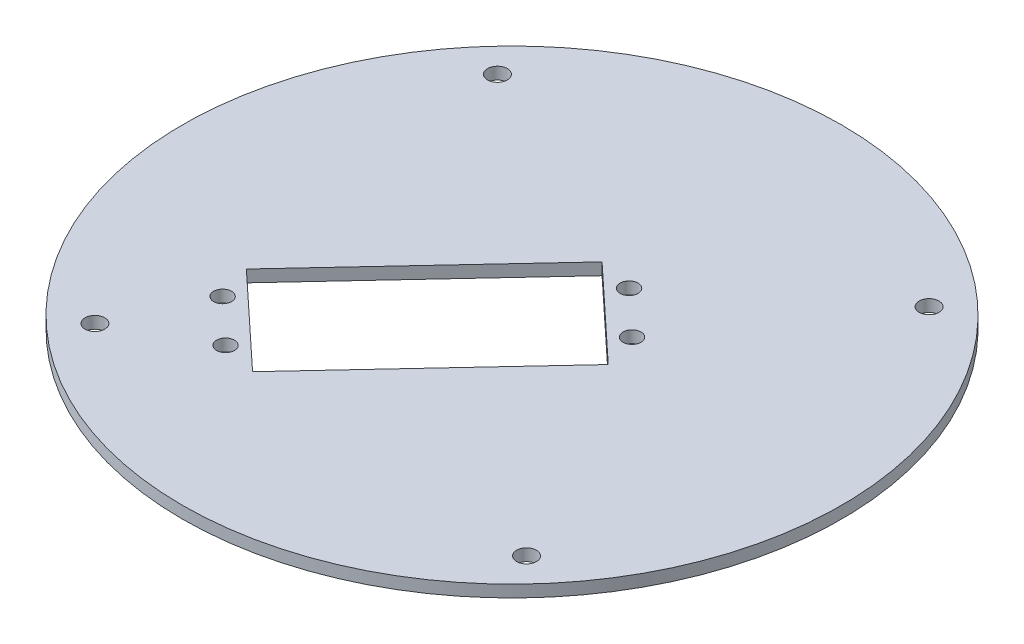
ISO-10303-21;
HEADER;
FILE_DESCRIPTION(('STEP AP214'),'2;1');
FILE_NAME('part.step','',(''),(''),'','','');
FILE_SCHEMA(('AUTOMOTIVE_DESIGN { 1 0 10303 214 1 1 1 1 }'));
ENDSEC;
DATA;
#1=APPLICATION_CONTEXT('core data for automotive mechanical design processes');
#2=APPLICATION_PROTOCOL_DEFINITION('international standard','automotive_design',2000,#1);
#3=PRODUCT_CONTEXT('',#1,'mechanical');
#4=PRODUCT('Part','Part','',(#3));
#5=PRODUCT_RELATED_PRODUCT_CATEGORY('part','',(#4));
#6=PRODUCT_DEFINITION_FORMATION('','',#4);
#7=PRODUCT_DEFINITION_CONTEXT('part definition',#1,'design');
#8=PRODUCT_DEFINITION('design','',#6,#7);
#9=PRODUCT_DEFINITION_SHAPE('','',#8);
#10=(LENGTH_UNIT() NAMED_UNIT(*) SI_UNIT(.MILLI.,.METRE.));
#11=(NAMED_UNIT(*) PLANE_ANGLE_UNIT() SI_UNIT($,.RADIAN.));
#12=(NAMED_UNIT(*) SI_UNIT($,.STERADIAN.) SOLID_ANGLE_UNIT());
#13=UNCERTAINTY_MEASURE_WITH_UNIT(LENGTH_MEASURE(1.E-05),#10,'distance_accuracy_value','');
#14=(GEOMETRIC_REPRESENTATION_CONTEXT(3) GLOBAL_UNCERTAINTY_ASSIGNED_CONTEXT((#13)) GLOBAL_UNIT_ASSIGNED_CONTEXT((#10,
#11,#12)) REPRESENTATION_CONTEXT('',''));
#15=CARTESIAN_POINT('',(0.,0.,0.));
#16=DIRECTION('',(0.,0.,1.));
#17=DIRECTION('',(1.,0.,0.));
#18=AXIS2_PLACEMENT_3D('',#15,#16,#17);
#19=CARTESIAN_POINT('',(0.,2.,0.));
#20=DIRECTION('',(0.,-1.,0.));
#21=DIRECTION('',(0.,0.,-1.));
#22=AXIS2_PLACEMENT_3D('',#19,#20,#21);
#23=CYLINDRICAL_SURFACE('',#22,55.);
#24=CARTESIAN_POINT('',(0.,2.,0.));
#25=DIRECTION('',(0.,1.,0.));
#26=DIRECTION('',(0.,0.,1.));
#27=AXIS2_PLACEMENT_3D('',#24,#25,#26);
#28=CIRCLE('',#27,55.);
#29=CARTESIAN_POINT('',(0.,2.,55.));
#30=VERTEX_POINT('',#29);
#31=EDGE_CURVE('E134',#30,#30,#28,.T.);
#32=ORIENTED_EDGE('',*,*,#31,.F.);
#33=EDGE_LOOP('',(#32));
#34=FACE_BOUND('',#33,.T.);
#35=CARTESIAN_POINT('',(0.,0.,0.));
#36=DIRECTION('',(0.,1.,0.));
#37=DIRECTION('',(0.,0.,1.));
#38=AXIS2_PLACEMENT_3D('',#35,#36,#37);
#39=CIRCLE('',#38,55.);
#40=CARTESIAN_POINT('',(0.,0.,55.));
#41=VERTEX_POINT('',#40);
#42=EDGE_CURVE('E131',#41,#41,#39,.T.);
#43=ORIENTED_EDGE('',*,*,#42,.T.);
#44=EDGE_LOOP('',(#43));
#45=FACE_BOUND('',#44,.T.);
#46=ADVANCED_FACE('F38',(#34,#45),#23,.T.);
#47=CARTESIAN_POINT('',(0.,2.,0.));
#48=DIRECTION('',(0.,1.,0.));
#49=DIRECTION('',(0.,0.,1.));
#50=AXIS2_PLACEMENT_3D('',#47,#48,#49);
#51=PLANE('',#50);
#52=CARTESIAN_POINT('',(13.2052125144257,2.,-6.82805700392381));
#53=DIRECTION('',(0.,1.,0.));
#54=DIRECTION('',(0.,0.,1.));
#55=AXIS2_PLACEMENT_3D('',#52,#53,#54);
#56=CIRCLE('',#55,1.50000000000064);
#57=CARTESIAN_POINT('',(13.2052125144257,2.,-5.32805700392318));
#58=VERTEX_POINT('',#57);
#59=EDGE_CURVE('E240',#58,#58,#56,.T.);
#60=ORIENTED_EDGE('',*,*,#59,.F.);
#61=EDGE_LOOP('',(#60));
#62=FACE_BOUND('',#61,.T.);
#63=CARTESIAN_POINT('',(5.89214189781606,2.,-13.648540722582));
#64=DIRECTION('',(0.,1.,0.));
#65=DIRECTION('',(0.,0.,1.));
#66=AXIS2_PLACEMENT_3D('',#63,#64,#65);
#67=CIRCLE('',#66,1.50000000000069);
#68=CARTESIAN_POINT('',(5.89214189781606,2.,-12.1485407225813));
#69=VERTEX_POINT('',#68);
#70=EDGE_CURVE('E242',#69,#69,#67,.T.);
#71=ORIENTED_EDGE('',*,*,#70,.F.);
#72=EDGE_LOOP('',(#71));
#73=FACE_BOUND('',#72,.T.);
#74=CARTESIAN_POINT('',(-19.5331093351335,2.,28.2746819558017));
#75=DIRECTION('',(0.,1.,0.));
#76=DIRECTION('',(0.,0.,1.));
#77=AXIS2_PLACEMENT_3D('',#74,#75,#76);
#78=CIRCLE('',#77,1.5);
#79=CARTESIAN_POINT('',(-19.5331093351335,2.,29.7746819558017));
#80=VERTEX_POINT('',#79);
#81=EDGE_CURVE('E237',#80,#80,#78,.T.);
#82=ORIENTED_EDGE('',*,*,#81,.F.);
#83=EDGE_LOOP('',(#82));
#84=FACE_BOUND('',#83,.T.);
#85=CARTESIAN_POINT('',(-26.8461799517431,2.,21.4541982371436));
#86=DIRECTION('',(0.,1.,0.));
#87=DIRECTION('',(0.,0.,1.));
#88=AXIS2_PLACEMENT_3D('',#85,#86,#87);
#89=CIRCLE('',#88,1.5);
#90=CARTESIAN_POINT('',(-26.8461799517431,2.,22.9541982371436));
#91=VERTEX_POINT('',#90);
#92=EDGE_CURVE('E235',#91,#91,#89,.T.);
#93=ORIENTED_EDGE('',*,*,#92,.F.);
#94=EDGE_LOOP('',(#93));
#95=FACE_BOUND('',#94,.T.);
#96=DIRECTION('',(0.731307061660964,0.,0.682048371865814));
#97=VECTOR('',#96,1.);
#98=CARTESIAN_POINT('',(-13.4647753804003,2.,29.8320268160818));
#99=LINE('',#98,#97);
#100=CARTESIAN_POINT('',(-28.8222236752809,2.,15.5090110068993));
#101=VERTEX_POINT('',#100);
#102=CARTESIAN_POINT('',(-13.4647753804003,2.,29.8320268160818));
#103=VERTEX_POINT('',#102);
#104=EDGE_CURVE('E54',#101,#103,#99,.T.);
#105=ORIENTED_EDGE('',*,*,#104,.F.);
#106=DIRECTION('',(-0.682048371865815,0.,0.731307061660963));
#107=VECTOR('',#106,1.);
#108=CARTESIAN_POINT('',(-28.8222236752809,2.,15.5090110068993));
#109=LINE('',#108,#107);
#110=CARTESIAN_POINT('',(-0.176192056916675,2.,-15.2058855828611));
#111=VERTEX_POINT('',#110);
#112=EDGE_CURVE('E99',#111,#101,#109,.T.);
#113=ORIENTED_EDGE('',*,*,#112,.F.);
#114=DIRECTION('',(-0.731307061660963,0.,-0.682048371865815));
#115=VECTOR('',#114,1.);
#116=CARTESIAN_POINT('',(-0.176192056916675,2.,-15.2058855828611));
#117=LINE('',#116,#115);
#118=CARTESIAN_POINT('',(15.1812562379635,2.,-0.882869773678998));
#119=VERTEX_POINT('',#118);
#120=EDGE_CURVE('E83',#119,#111,#117,.T.);
#121=ORIENTED_EDGE('',*,*,#120,.F.);
#122=DIRECTION('',(0.682048371865806,0.,-0.731307061660971));
#123=VECTOR('',#122,1.);
#124=CARTESIAN_POINT('',(15.1812562379635,2.,-0.882869773678998));
#125=LINE('',#124,#123);
#126=EDGE_CURVE('E92',#103,#119,#125,.T.);
#127=ORIENTED_EDGE('',*,*,#126,.F.);
#128=EDGE_LOOP('',(#105,#113,#121,#127));
#129=FACE_BOUND('',#128,.T.);
#130=CARTESIAN_POINT('',(-33.5908823143915,2.,36.0168727868026));
#131=DIRECTION('',(0.,1.,0.));
#132=DIRECTION('',(0.,0.,1.));
#133=AXIS2_PLACEMENT_3D('',#130,#131,#132);
#134=CIRCLE('',#133,1.65);
#135=CARTESIAN_POINT('',(-33.5908823143915,2.,37.6668727868026));
#136=VERTEX_POINT('',#135);
#137=EDGE_CURVE('E113',#136,#136,#134,.T.);
#138=ORIENTED_EDGE('',*,*,#137,.F.);
#139=EDGE_LOOP('',(#138));
#140=FACE_BOUND('',#139,.T.);
#141=CARTESIAN_POINT('',(-36.0168727868026,2.,-33.5908823143915));
#142=DIRECTION('',(0.,1.,0.));
#143=DIRECTION('',(0.,0.,1.));
#144=AXIS2_PLACEMENT_3D('',#141,#142,#143);
#145=CIRCLE('',#144,1.65);
#146=CARTESIAN_POINT('',(-36.0168727868026,2.,-31.9408823143915));
#147=VERTEX_POINT('',#146);
#148=EDGE_CURVE('E116',#147,#147,#145,.T.);
#149=ORIENTED_EDGE('',*,*,#148,.F.);
#150=EDGE_LOOP('',(#149));
#151=FACE_BOUND('',#150,.T.);
#152=CARTESIAN_POINT('',(33.5908823143915,2.,-36.0168727868026));
#153=DIRECTION('',(0.,1.,0.));
#154=DIRECTION('',(0.,0.,1.));
#155=AXIS2_PLACEMENT_3D('',#152,#153,#154);
#156=CIRCLE('',#155,1.65);
#157=CARTESIAN_POINT('',(33.5908823143915,2.,-34.3668727868026));
#158=VERTEX_POINT('',#157);
#159=EDGE_CURVE('E122',#158,#158,#156,.T.);
#160=ORIENTED_EDGE('',*,*,#159,.F.);
#161=EDGE_LOOP('',(#160));
#162=FACE_BOUND('',#161,.T.);
#163=CARTESIAN_POINT('',(36.0168727868026,2.,33.5908823143915));
#164=DIRECTION('',(0.,1.,0.));
#165=DIRECTION('',(0.,0.,1.));
#166=AXIS2_PLACEMENT_3D('',#163,#164,#165);
#167=CIRCLE('',#166,1.65);
#168=CARTESIAN_POINT('',(36.0168727868026,2.,35.2408823143915));
#169=VERTEX_POINT('',#168);
#170=EDGE_CURVE('E112',#169,#169,#167,.T.);
#171=ORIENTED_EDGE('',*,*,#170,.F.);
#172=EDGE_LOOP('',(#171));
#173=FACE_BOUND('',#172,.T.);
#174=ORIENTED_EDGE('',*,*,#31,.T.);
#175=EDGE_LOOP('',(#174));
#176=FACE_BOUND('',#175,.T.);
#177=ADVANCED_FACE('F96',(#62,#73,#84,#95,#129,#140,#151,#162,#173,#176),#51,.T.);
#178=CARTESIAN_POINT('',(0.,0.,0.));
#179=DIRECTION('',(0.,1.,0.));
#180=DIRECTION('',(0.,0.,1.));
#181=AXIS2_PLACEMENT_3D('',#178,#179,#180);
#182=PLANE('',#181);
#183=CARTESIAN_POINT('',(13.2052125144257,0.,-6.82805700392381));
#184=DIRECTION('',(0.,1.,0.));
#185=DIRECTION('',(0.,0.,1.));
#186=AXIS2_PLACEMENT_3D('',#183,#184,#185);
#187=CIRCLE('',#186,1.50000000000064);
#188=CARTESIAN_POINT('',(13.2052125144257,0.,-5.32805700392318));
#189=VERTEX_POINT('',#188);
#190=EDGE_CURVE('E41',#189,#189,#187,.T.);
#191=ORIENTED_EDGE('',*,*,#190,.T.);
#192=EDGE_LOOP('',(#191));
#193=FACE_BOUND('',#192,.T.);
#194=CARTESIAN_POINT('',(5.89214189781606,0.,-13.648540722582));
#195=DIRECTION('',(0.,1.,0.));
#196=DIRECTION('',(0.,0.,1.));
#197=AXIS2_PLACEMENT_3D('',#194,#195,#196);
#198=CIRCLE('',#197,1.50000000000069);
#199=CARTESIAN_POINT('',(5.89214189781606,0.,-12.1485407225813));
#200=VERTEX_POINT('',#199);
#201=EDGE_CURVE('E148',#200,#200,#198,.T.);
#202=ORIENTED_EDGE('',*,*,#201,.T.);
#203=EDGE_LOOP('',(#202));
#204=FACE_BOUND('',#203,.T.);
#205=CARTESIAN_POINT('',(-19.5331093351335,0.,28.2746819558017));
#206=DIRECTION('',(0.,1.,0.));
#207=DIRECTION('',(0.,0.,1.));
#208=AXIS2_PLACEMENT_3D('',#205,#206,#207);
#209=CIRCLE('',#208,1.5);
#210=CARTESIAN_POINT('',(-19.5331093351335,0.,29.7746819558017));
#211=VERTEX_POINT('',#210);
#212=EDGE_CURVE('E146',#211,#211,#209,.T.);
#213=ORIENTED_EDGE('',*,*,#212,.T.);
#214=EDGE_LOOP('',(#213));
#215=FACE_BOUND('',#214,.T.);
#216=CARTESIAN_POINT('',(-26.8461799517431,0.,21.4541982371436));
#217=DIRECTION('',(0.,1.,0.));
#218=DIRECTION('',(0.,0.,1.));
#219=AXIS2_PLACEMENT_3D('',#216,#217,#218);
#220=CIRCLE('',#219,1.5);
#221=CARTESIAN_POINT('',(-26.8461799517431,0.,22.9541982371436));
#222=VERTEX_POINT('',#221);
#223=EDGE_CURVE('E106',#222,#222,#220,.T.);
#224=ORIENTED_EDGE('',*,*,#223,.T.);
#225=EDGE_LOOP('',(#224));
#226=FACE_BOUND('',#225,.T.);
#227=DIRECTION('',(-0.682048371865815,0.,0.731307061660963));
#228=VECTOR('',#227,1.);
#229=CARTESIAN_POINT('',(-7.67872414744012,0.,-7.16150790459107));
#230=LINE('',#229,#228);
#231=CARTESIAN_POINT('',(-0.176192056916675,0.,-15.2058855828611));
#232=VERTEX_POINT('',#231);
#233=CARTESIAN_POINT('',(-28.8222236752809,0.,15.5090110068993));
#234=VERTEX_POINT('',#233);
#235=EDGE_CURVE('E46',#232,#234,#230,.T.);
#236=ORIENTED_EDGE('',*,*,#235,.T.);
#237=DIRECTION('',(0.731307061660964,0.,0.682048371865814));
#238=VECTOR('',#237,1.);
#239=CARTESIAN_POINT('',(-21.1434995278408,0.,22.6705189114904));
#240=LINE('',#239,#238);
#241=CARTESIAN_POINT('',(-13.4647753804003,0.,29.8320268160818));
#242=VERTEX_POINT('',#241);
#243=EDGE_CURVE('E11',#234,#242,#240,.T.);
#244=ORIENTED_EDGE('',*,*,#243,.T.);
#245=DIRECTION('',(0.682048371865806,0.,-0.731307061660971));
#246=VECTOR('',#245,1.);
#247=CARTESIAN_POINT('',(7.67872414744028,0.,7.16150790459104));
#248=LINE('',#247,#246);
#249=CARTESIAN_POINT('',(15.1812562379635,0.,-0.882869773678997));
#250=VERTEX_POINT('',#249);
#251=EDGE_CURVE('E137',#242,#250,#248,.T.);
#252=ORIENTED_EDGE('',*,*,#251,.T.);
#253=DIRECTION('',(-0.731307061660963,0.,-0.682048371865815));
#254=VECTOR('',#253,1.);
#255=CARTESIAN_POINT('',(7.50253209052345,0.,-8.04437767827004));
#256=LINE('',#255,#254);
#257=EDGE_CURVE('E86',#250,#232,#256,.T.);
#258=ORIENTED_EDGE('',*,*,#257,.T.);
#259=EDGE_LOOP('',(#236,#244,#252,#258));
#260=FACE_BOUND('',#259,.T.);
#261=CARTESIAN_POINT('',(-33.5908823143915,0.,36.0168727868026));
#262=DIRECTION('',(0.,1.,0.));
#263=DIRECTION('',(0.,0.,1.));
#264=AXIS2_PLACEMENT_3D('',#261,#262,#263);
#265=CIRCLE('',#264,1.65);
#266=CARTESIAN_POINT('',(-33.5908823143915,0.,37.6668727868026));
#267=VERTEX_POINT('',#266);
#268=EDGE_CURVE('E109',#267,#267,#265,.T.);
#269=ORIENTED_EDGE('',*,*,#268,.T.);
#270=EDGE_LOOP('',(#269));
#271=FACE_BOUND('',#270,.T.);
#272=CARTESIAN_POINT('',(-36.0168727868026,0.,-33.5908823143915));
#273=DIRECTION('',(0.,1.,0.));
#274=DIRECTION('',(0.,0.,1.));
#275=AXIS2_PLACEMENT_3D('',#272,#273,#274);
#276=CIRCLE('',#275,1.65);
#277=CARTESIAN_POINT('',(-36.0168727868026,0.,-31.9408823143915));
#278=VERTEX_POINT('',#277);
#279=EDGE_CURVE('E119',#278,#278,#276,.T.);
#280=ORIENTED_EDGE('',*,*,#279,.T.);
#281=EDGE_LOOP('',(#280));
#282=FACE_BOUND('',#281,.T.);
#283=CARTESIAN_POINT('',(33.5908823143915,0.,-36.0168727868026));
#284=DIRECTION('',(0.,1.,0.));
#285=DIRECTION('',(0.,0.,1.));
#286=AXIS2_PLACEMENT_3D('',#283,#284,#285);
#287=CIRCLE('',#286,1.65);
#288=CARTESIAN_POINT('',(33.5908823143915,0.,-34.3668727868026));
#289=VERTEX_POINT('',#288);
#290=EDGE_CURVE('E125',#289,#289,#287,.T.);
#291=ORIENTED_EDGE('',*,*,#290,.T.);
#292=EDGE_LOOP('',(#291));
#293=FACE_BOUND('',#292,.T.);
#294=CARTESIAN_POINT('',(36.0168727868026,0.,33.5908823143915));
#295=DIRECTION('',(0.,1.,0.));
#296=DIRECTION('',(0.,0.,1.));
#297=AXIS2_PLACEMENT_3D('',#294,#295,#296);
#298=CIRCLE('',#297,1.65);
#299=CARTESIAN_POINT('',(36.0168727868026,0.,35.2408823143915));
#300=VERTEX_POINT('',#299);
#301=EDGE_CURVE('E128',#300,#300,#298,.T.);
#302=ORIENTED_EDGE('',*,*,#301,.T.);
#303=EDGE_LOOP('',(#302));
#304=FACE_BOUND('',#303,.T.);
#305=ORIENTED_EDGE('',*,*,#42,.F.);
#306=EDGE_LOOP('',(#305));
#307=FACE_BOUND('',#306,.T.);
#308=ADVANCED_FACE('F155',(#193,#204,#215,#226,#260,#271,#282,#293,#304,#307),#182,.F.);
#309=CARTESIAN_POINT('',(36.0168727868026,0.,33.5908823143915));
#310=DIRECTION('',(0.,1.,0.));
#311=DIRECTION('',(0.,0.,1.));
#312=AXIS2_PLACEMENT_3D('',#309,#310,#311);
#313=CYLINDRICAL_SURFACE('',#312,1.65);
#314=ORIENTED_EDGE('',*,*,#301,.F.);
#315=EDGE_LOOP('',(#314));
#316=FACE_BOUND('',#315,.T.);
#317=ORIENTED_EDGE('',*,*,#170,.T.);
#318=EDGE_LOOP('',(#317));
#319=FACE_BOUND('',#318,.T.);
#320=ADVANCED_FACE('F182',(#316,#319),#313,.F.);
#321=CARTESIAN_POINT('',(33.5908823143915,0.,-36.0168727868026));
#322=DIRECTION('',(0.,1.,0.));
#323=DIRECTION('',(0.,0.,1.));
#324=AXIS2_PLACEMENT_3D('',#321,#322,#323);
#325=CYLINDRICAL_SURFACE('',#324,1.65);
#326=ORIENTED_EDGE('',*,*,#290,.F.);
#327=EDGE_LOOP('',(#326));
#328=FACE_BOUND('',#327,.T.);
#329=ORIENTED_EDGE('',*,*,#159,.T.);
#330=EDGE_LOOP('',(#329));
#331=FACE_BOUND('',#330,.T.);
#332=ADVANCED_FACE('F186',(#328,#331),#325,.F.);
#333=CARTESIAN_POINT('',(-36.0168727868026,0.,-33.5908823143915));
#334=DIRECTION('',(0.,1.,0.));
#335=DIRECTION('',(0.,0.,1.));
#336=AXIS2_PLACEMENT_3D('',#333,#334,#335);
#337=CYLINDRICAL_SURFACE('',#336,1.65);
#338=ORIENTED_EDGE('',*,*,#279,.F.);
#339=EDGE_LOOP('',(#338));
#340=FACE_BOUND('',#339,.T.);
#341=ORIENTED_EDGE('',*,*,#148,.T.);
#342=EDGE_LOOP('',(#341));
#343=FACE_BOUND('',#342,.T.);
#344=ADVANCED_FACE('F192',(#340,#343),#337,.F.);
#345=CARTESIAN_POINT('',(-33.5908823143915,0.,36.0168727868026));
#346=DIRECTION('',(0.,1.,0.));
#347=DIRECTION('',(0.,0.,1.));
#348=AXIS2_PLACEMENT_3D('',#345,#346,#347);
#349=CYLINDRICAL_SURFACE('',#348,1.65);
#350=ORIENTED_EDGE('',*,*,#268,.F.);
#351=EDGE_LOOP('',(#350));
#352=FACE_BOUND('',#351,.T.);
#353=ORIENTED_EDGE('',*,*,#137,.T.);
#354=EDGE_LOOP('',(#353));
#355=FACE_BOUND('',#354,.T.);
#356=ADVANCED_FACE('F196',(#352,#355),#349,.F.);
#357=CARTESIAN_POINT('',(-13.4647753804003,-8.,29.8320268160818));
#358=DIRECTION('',(-0.682048371865814,0.,0.731307061660964));
#359=DIRECTION('',(0.731307061660964,0.,0.682048371865814));
#360=AXIS2_PLACEMENT_3D('',#357,#358,#359);
#361=PLANE('',#360);
#362=DIRECTION('',(0.,1.,0.));
#363=VECTOR('',#362,1.);
#364=CARTESIAN_POINT('',(-28.8222236752809,-8.,15.5090110068993));
#365=LINE('',#364,#363);
#366=EDGE_CURVE('E104',#234,#101,#365,.T.);
#367=ORIENTED_EDGE('',*,*,#366,.T.);
#368=ORIENTED_EDGE('',*,*,#104,.T.);
#369=DIRECTION('',(0.,1.,0.));
#370=VECTOR('',#369,1.);
#371=CARTESIAN_POINT('',(-13.4647753804003,-8.,29.8320268160818));
#372=LINE('',#371,#370);
#373=EDGE_CURVE('E89',#242,#103,#372,.T.);
#374=ORIENTED_EDGE('',*,*,#373,.F.);
#375=ORIENTED_EDGE('',*,*,#243,.F.);
#376=EDGE_LOOP('',(#367,#368,#374,#375));
#377=FACE_BOUND('',#376,.T.);
#378=ADVANCED_FACE('F200',(#377),#361,.F.);
#379=CARTESIAN_POINT('',(-28.8222236752809,-8.,15.5090110068993));
#380=DIRECTION('',(-0.731307061660963,0.,-0.682048371865815));
#381=DIRECTION('',(-0.682048371865815,0.,0.731307061660963));
#382=AXIS2_PLACEMENT_3D('',#379,#380,#381);
#383=PLANE('',#382);
#384=DIRECTION('',(0.,1.,0.));
#385=VECTOR('',#384,1.);
#386=CARTESIAN_POINT('',(-0.176192056916675,-8.,-15.2058855828611));
#387=LINE('',#386,#385);
#388=EDGE_CURVE('E88',#232,#111,#387,.T.);
#389=ORIENTED_EDGE('',*,*,#388,.T.);
#390=ORIENTED_EDGE('',*,*,#112,.T.);
#391=ORIENTED_EDGE('',*,*,#366,.F.);
#392=ORIENTED_EDGE('',*,*,#235,.F.);
#393=EDGE_LOOP('',(#389,#390,#391,#392));
#394=FACE_BOUND('',#393,.T.);
#395=ADVANCED_FACE('F204',(#394),#383,.F.);
#396=CARTESIAN_POINT('',(-0.176192056916675,-8.,-15.2058855828611));
#397=DIRECTION('',(0.682048371865815,0.,-0.731307061660963));
#398=DIRECTION('',(-0.731307061660963,0.,-0.682048371865815));
#399=AXIS2_PLACEMENT_3D('',#396,#397,#398);
#400=PLANE('',#399);
#401=DIRECTION('',(0.,1.,0.));
#402=VECTOR('',#401,1.);
#403=CARTESIAN_POINT('',(15.1812562379635,-8.,-0.882869773678998));
#404=LINE('',#403,#402);
#405=EDGE_CURVE('E62',#250,#119,#404,.T.);
#406=ORIENTED_EDGE('',*,*,#405,.T.);
#407=ORIENTED_EDGE('',*,*,#120,.T.);
#408=ORIENTED_EDGE('',*,*,#388,.F.);
#409=ORIENTED_EDGE('',*,*,#257,.F.);
#410=EDGE_LOOP('',(#406,#407,#408,#409));
#411=FACE_BOUND('',#410,.T.);
#412=ADVANCED_FACE('F80',(#411),#400,.F.);
#413=CARTESIAN_POINT('',(15.1812562379635,-8.,-0.882869773678998));
#414=DIRECTION('',(0.731307061660971,0.,0.682048371865806));
#415=DIRECTION('',(0.682048371865806,0.,-0.731307061660971));
#416=AXIS2_PLACEMENT_3D('',#413,#414,#415);
#417=PLANE('',#416);
#418=ORIENTED_EDGE('',*,*,#373,.T.);
#419=ORIENTED_EDGE('',*,*,#126,.T.);
#420=ORIENTED_EDGE('',*,*,#405,.F.);
#421=ORIENTED_EDGE('',*,*,#251,.F.);
#422=EDGE_LOOP('',(#418,#419,#420,#421));
#423=FACE_BOUND('',#422,.T.);
#424=ADVANCED_FACE('F93',(#423),#417,.F.);
#425=CARTESIAN_POINT('',(-26.8461799517431,-8.,21.4541982371436));
#426=DIRECTION('',(0.,1.,0.));
#427=DIRECTION('',(0.,0.,1.));
#428=AXIS2_PLACEMENT_3D('',#425,#426,#427);
#429=CYLINDRICAL_SURFACE('',#428,1.5);
#430=ORIENTED_EDGE('',*,*,#92,.T.);
#431=EDGE_LOOP('',(#430));
#432=FACE_BOUND('',#431,.T.);
#433=ORIENTED_EDGE('',*,*,#223,.F.);
#434=EDGE_LOOP('',(#433));
#435=FACE_BOUND('',#434,.T.);
#436=ADVANCED_FACE('F207',(#432,#435),#429,.F.);
#437=CARTESIAN_POINT('',(-19.5331093351335,-8.,28.2746819558017));
#438=DIRECTION('',(0.,1.,0.));
#439=DIRECTION('',(0.,0.,1.));
#440=AXIS2_PLACEMENT_3D('',#437,#438,#439);
#441=CYLINDRICAL_SURFACE('',#440,1.5);
#442=ORIENTED_EDGE('',*,*,#81,.T.);
#443=EDGE_LOOP('',(#442));
#444=FACE_BOUND('',#443,.T.);
#445=ORIENTED_EDGE('',*,*,#212,.F.);
#446=EDGE_LOOP('',(#445));
#447=FACE_BOUND('',#446,.T.);
#448=ADVANCED_FACE('F165',(#444,#447),#441,.F.);
#449=CARTESIAN_POINT('',(5.89214189781606,-8.,-13.648540722582));
#450=DIRECTION('',(0.,1.,0.));
#451=DIRECTION('',(0.,0.,1.));
#452=AXIS2_PLACEMENT_3D('',#449,#450,#451);
#453=CYLINDRICAL_SURFACE('',#452,1.50000000000069);
#454=ORIENTED_EDGE('',*,*,#70,.T.);
#455=EDGE_LOOP('',(#454));
#456=FACE_BOUND('',#455,.T.);
#457=ORIENTED_EDGE('',*,*,#201,.F.);
#458=EDGE_LOOP('',(#457));
#459=FACE_BOUND('',#458,.T.);
#460=ADVANCED_FACE('F159',(#456,#459),#453,.F.);
#461=CARTESIAN_POINT('',(13.2052125144257,-8.,-6.82805700392381));
#462=DIRECTION('',(0.,1.,0.));
#463=DIRECTION('',(0.,0.,1.));
#464=AXIS2_PLACEMENT_3D('',#461,#462,#463);
#465=CYLINDRICAL_SURFACE('',#464,1.50000000000064);
#466=ORIENTED_EDGE('',*,*,#59,.T.);
#467=EDGE_LOOP('',(#466));
#468=FACE_BOUND('',#467,.T.);
#469=ORIENTED_EDGE('',*,*,#190,.F.);
#470=EDGE_LOOP('',(#469));
#471=FACE_BOUND('',#470,.T.);
#472=ADVANCED_FACE('F157',(#468,#471),#465,.F.);
#473=CLOSED_SHELL('',(#46,#177,#308,#320,#332,#344,#356,#378,#395,#412,#424,#436,#448,#460,#472));
#474=MANIFOLD_SOLID_BREP('B2',#473);
#475=ADVANCED_BREP_SHAPE_REPRESENTATION('',(#18,#474),#14);
#476=SHAPE_DEFINITION_REPRESENTATION(#9,#475);
ENDSEC;
END-ISO-10303-21;
